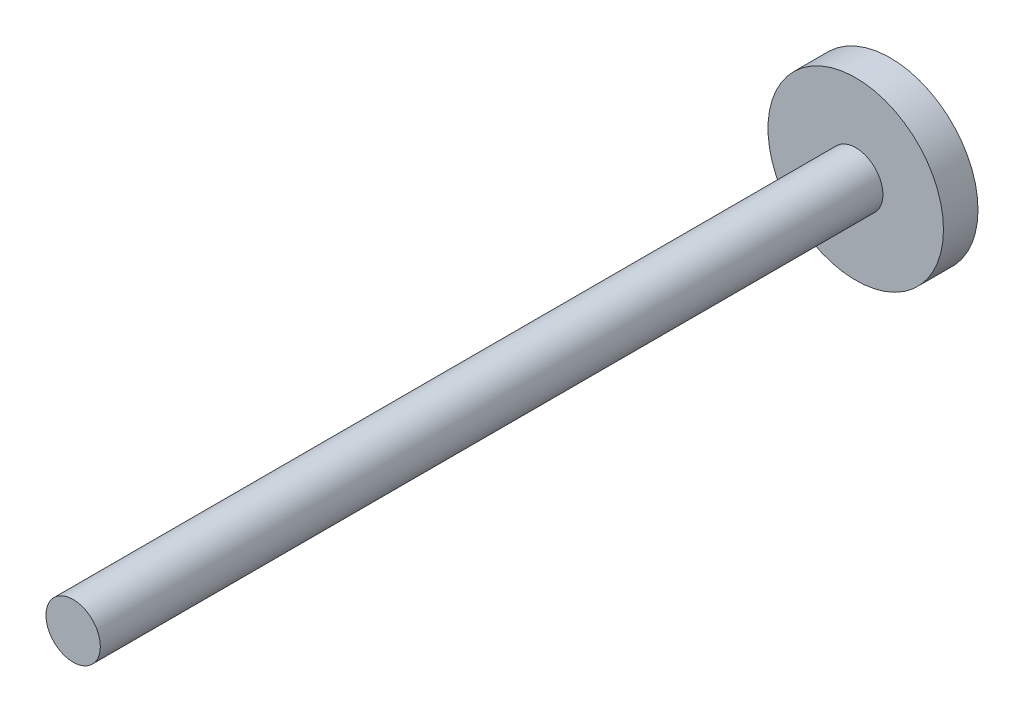
ISO-10303-21;
HEADER;
FILE_DESCRIPTION(('STEP AP214'),'2;1');
FILE_NAME('part.step','',(''),(''),'','','');
FILE_SCHEMA(('AUTOMOTIVE_DESIGN { 1 0 10303 214 1 1 1 1 }'));
ENDSEC;
DATA;
#1=APPLICATION_CONTEXT('core data for automotive mechanical design processes');
#2=APPLICATION_PROTOCOL_DEFINITION('international standard','automotive_design',2000,#1);
#3=PRODUCT_CONTEXT('',#1,'mechanical');
#4=PRODUCT('Part','Part','',(#3));
#5=PRODUCT_RELATED_PRODUCT_CATEGORY('part','',(#4));
#6=PRODUCT_DEFINITION_FORMATION('','',#4);
#7=PRODUCT_DEFINITION_CONTEXT('part definition',#1,'design');
#8=PRODUCT_DEFINITION('design','',#6,#7);
#9=PRODUCT_DEFINITION_SHAPE('','',#8);
#10=(LENGTH_UNIT() NAMED_UNIT(*) SI_UNIT(.MILLI.,.METRE.));
#11=(NAMED_UNIT(*) PLANE_ANGLE_UNIT() SI_UNIT($,.RADIAN.));
#12=(NAMED_UNIT(*) SI_UNIT($,.STERADIAN.) SOLID_ANGLE_UNIT());
#13=UNCERTAINTY_MEASURE_WITH_UNIT(LENGTH_MEASURE(1.E-05),#10,'distance_accuracy_value','');
#14=(GEOMETRIC_REPRESENTATION_CONTEXT(3) GLOBAL_UNCERTAINTY_ASSIGNED_CONTEXT((#13)) GLOBAL_UNIT_ASSIGNED_CONTEXT((#10,
#11,#12)) REPRESENTATION_CONTEXT('',''));
#15=CARTESIAN_POINT('',(0.,0.,0.));
#16=DIRECTION('',(0.,0.,1.));
#17=DIRECTION('',(1.,0.,0.));
#18=AXIS2_PLACEMENT_3D('',#15,#16,#17);
#19=CARTESIAN_POINT('',(0.,0.,5.));
#20=DIRECTION('',(0.,0.,1.));
#21=DIRECTION('',(1.,0.,0.));
#22=AXIS2_PLACEMENT_3D('',#19,#20,#21);
#23=PLANE('',#22);
#24=CARTESIAN_POINT('',(0.,0.,5.));
#25=DIRECTION('',(0.,0.,1.));
#26=DIRECTION('',(1.,0.,0.));
#27=AXIS2_PLACEMENT_3D('',#24,#25,#26);
#28=CIRCLE('',#27,12.7);
#29=CARTESIAN_POINT('',(12.7,0.,5.));
#30=VERTEX_POINT('',#29);
#31=EDGE_CURVE('E10',#30,#30,#28,.T.);
#32=ORIENTED_EDGE('',*,*,#31,.T.);
#33=EDGE_LOOP('',(#32));
#34=FACE_BOUND('',#33,.T.);
#35=CARTESIAN_POINT('',(0.,0.,5.));
#36=DIRECTION('',(0.,0.,1.));
#37=DIRECTION('',(1.,0.,0.));
#38=AXIS2_PLACEMENT_3D('',#35,#36,#37);
#39=CIRCLE('',#38,3.937);
#40=CARTESIAN_POINT('',(3.937,0.,5.));
#41=VERTEX_POINT('',#40);
#42=EDGE_CURVE('E44',#41,#41,#39,.T.);
#43=ORIENTED_EDGE('',*,*,#42,.F.);
#44=EDGE_LOOP('',(#43));
#45=FACE_BOUND('',#44,.T.);
#46=ADVANCED_FACE('F31',(#34,#45),#23,.T.);
#47=CARTESIAN_POINT('',(0.,0.,5.));
#48=DIRECTION('',(0.,0.,-1.));
#49=DIRECTION('',(-1.,0.,0.));
#50=AXIS2_PLACEMENT_3D('',#47,#48,#49);
#51=CYLINDRICAL_SURFACE('',#50,12.7);
#52=ORIENTED_EDGE('',*,*,#31,.F.);
#53=EDGE_LOOP('',(#52));
#54=FACE_BOUND('',#53,.T.);
#55=CARTESIAN_POINT('',(0.,0.,0.));
#56=DIRECTION('',(0.,0.,1.));
#57=DIRECTION('',(1.,0.,0.));
#58=AXIS2_PLACEMENT_3D('',#55,#56,#57);
#59=CIRCLE('',#58,12.7);
#60=CARTESIAN_POINT('',(12.7,0.,0.));
#61=VERTEX_POINT('',#60);
#62=EDGE_CURVE('E35',#61,#61,#59,.T.);
#63=ORIENTED_EDGE('',*,*,#62,.T.);
#64=EDGE_LOOP('',(#63));
#65=FACE_BOUND('',#64,.T.);
#66=ADVANCED_FACE('F33',(#54,#65),#51,.T.);
#67=CARTESIAN_POINT('',(0.,0.,0.));
#68=DIRECTION('',(0.,0.,1.));
#69=DIRECTION('',(1.,0.,0.));
#70=AXIS2_PLACEMENT_3D('',#67,#68,#69);
#71=PLANE('',#70);
#72=ORIENTED_EDGE('',*,*,#62,.F.);
#73=EDGE_LOOP('',(#72));
#74=FACE_BOUND('',#73,.T.);
#75=ADVANCED_FACE('F55',(#74),#71,.F.);
#76=CARTESIAN_POINT('',(0.,0.,118.284));
#77=DIRECTION('',(0.,0.,-1.));
#78=DIRECTION('',(-1.,0.,0.));
#79=AXIS2_PLACEMENT_3D('',#76,#77,#78);
#80=CYLINDRICAL_SURFACE('',#79,3.937);
#81=CARTESIAN_POINT('',(0.,0.,118.284));
#82=DIRECTION('',(0.,0.,1.));
#83=DIRECTION('',(1.,0.,0.));
#84=AXIS2_PLACEMENT_3D('',#81,#82,#83);
#85=CIRCLE('',#84,3.937);
#86=CARTESIAN_POINT('',(3.937,0.,118.284));
#87=VERTEX_POINT('',#86);
#88=EDGE_CURVE('E42',#87,#87,#85,.T.);
#89=ORIENTED_EDGE('',*,*,#88,.F.);
#90=EDGE_LOOP('',(#89));
#91=FACE_BOUND('',#90,.T.);
#92=ORIENTED_EDGE('',*,*,#42,.T.);
#93=EDGE_LOOP('',(#92));
#94=FACE_BOUND('',#93,.T.);
#95=ADVANCED_FACE('F52',(#91,#94),#80,.T.);
#96=CARTESIAN_POINT('',(0.,0.,118.284));
#97=DIRECTION('',(0.,0.,1.));
#98=DIRECTION('',(1.,0.,0.));
#99=AXIS2_PLACEMENT_3D('',#96,#97,#98);
#100=PLANE('',#99);
#101=ORIENTED_EDGE('',*,*,#88,.T.);
#102=EDGE_LOOP('',(#101));
#103=FACE_BOUND('',#102,.T.);
#104=ADVANCED_FACE('F50',(#103),#100,.T.);
#105=CLOSED_SHELL('',(#46,#66,#75,#95,#104));
#106=MANIFOLD_SOLID_BREP('B2',#105);
#107=ADVANCED_BREP_SHAPE_REPRESENTATION('',(#18,#106),#14);
#108=SHAPE_DEFINITION_REPRESENTATION(#9,#107);
ENDSEC;
END-ISO-10303-21;
